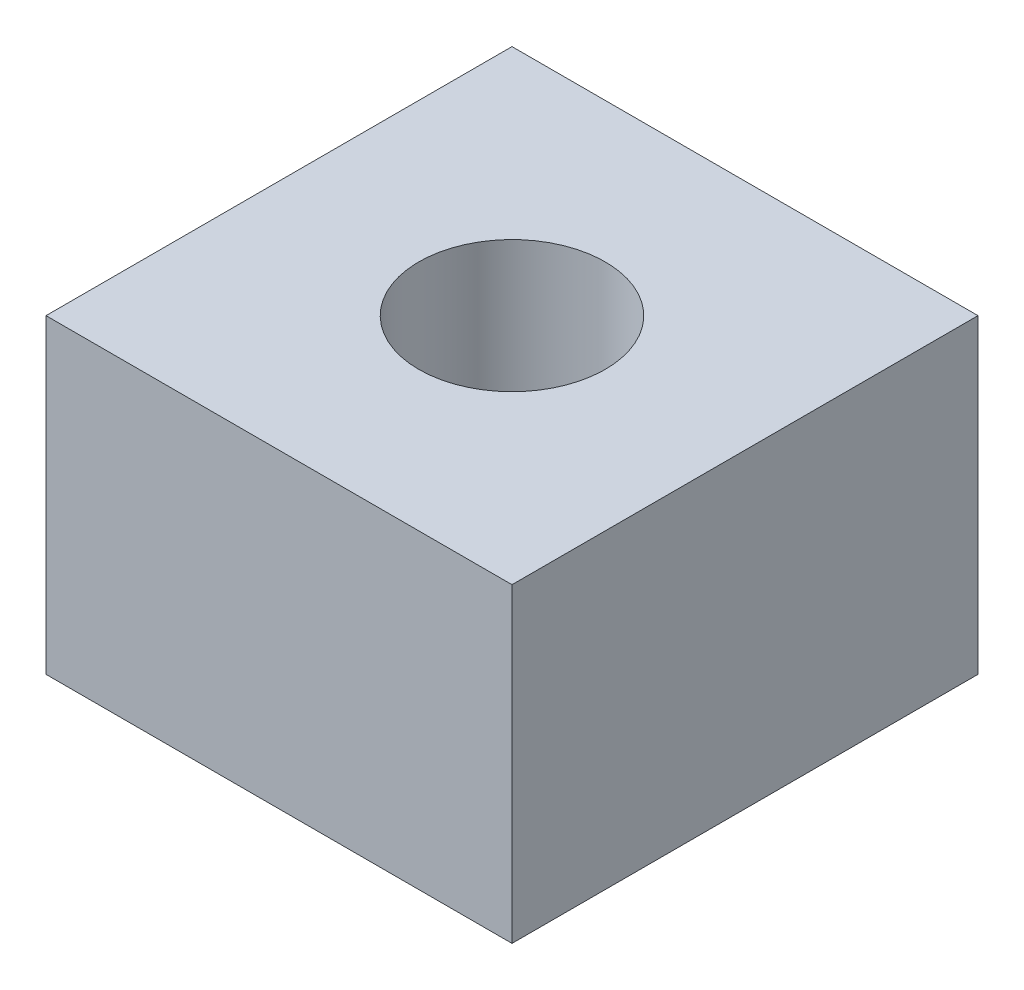
ISO-10303-21;
HEADER;
FILE_DESCRIPTION(('STEP AP214'),'2;1');
FILE_NAME('part.step','',(''),(''),'','','');
FILE_SCHEMA(('AUTOMOTIVE_DESIGN { 1 0 10303 214 1 1 1 1 }'));
ENDSEC;
DATA;
#1=APPLICATION_CONTEXT('core data for automotive mechanical design processes');
#2=APPLICATION_PROTOCOL_DEFINITION('international standard','automotive_design',2000,#1);
#3=PRODUCT_CONTEXT('',#1,'mechanical');
#4=PRODUCT('Part','Part','',(#3));
#5=PRODUCT_RELATED_PRODUCT_CATEGORY('part','',(#4));
#6=PRODUCT_DEFINITION_FORMATION('','',#4);
#7=PRODUCT_DEFINITION_CONTEXT('part definition',#1,'design');
#8=PRODUCT_DEFINITION('design','',#6,#7);
#9=PRODUCT_DEFINITION_SHAPE('','',#8);
#10=(LENGTH_UNIT() NAMED_UNIT(*) SI_UNIT(.MILLI.,.METRE.));
#11=(NAMED_UNIT(*) PLANE_ANGLE_UNIT() SI_UNIT($,.RADIAN.));
#12=(NAMED_UNIT(*) SI_UNIT($,.STERADIAN.) SOLID_ANGLE_UNIT());
#13=UNCERTAINTY_MEASURE_WITH_UNIT(LENGTH_MEASURE(1.E-05),#10,'distance_accuracy_value','');
#14=(GEOMETRIC_REPRESENTATION_CONTEXT(3) GLOBAL_UNCERTAINTY_ASSIGNED_CONTEXT((#13)) GLOBAL_UNIT_ASSIGNED_CONTEXT((#10,
#11,#12)) REPRESENTATION_CONTEXT('',''));
#15=CARTESIAN_POINT('',(0.,0.,0.));
#16=DIRECTION('',(0.,0.,1.));
#17=DIRECTION('',(1.,0.,0.));
#18=AXIS2_PLACEMENT_3D('',#15,#16,#17);
#19=CARTESIAN_POINT('',(-19.7814302383731,-7.77529588264711,30.));
#20=DIRECTION('',(1.,0.,0.));
#21=DIRECTION('',(0.,1.,0.));
#22=AXIS2_PLACEMENT_3D('',#19,#20,#21);
#23=PLANE('',#22);
#24=DIRECTION('',(0.,-1.,0.));
#25=VECTOR('',#24,1.);
#26=CARTESIAN_POINT('',(-19.7814302383731,-7.77529588264711,0.));
#27=LINE('',#26,#25);
#28=CARTESIAN_POINT('',(-19.7814302383731,-7.77529588264711,0.));
#29=VERTEX_POINT('',#28);
#30=CARTESIAN_POINT('',(-19.7814302383731,-27.7752958826471,0.));
#31=VERTEX_POINT('',#30);
#32=EDGE_CURVE('E108',#29,#31,#27,.T.);
#33=ORIENTED_EDGE('',*,*,#32,.T.);
#34=DIRECTION('',(0.,0.,-1.));
#35=VECTOR('',#34,1.);
#36=CARTESIAN_POINT('',(-19.7814302383731,-27.7752958826471,30.));
#37=LINE('',#36,#35);
#38=CARTESIAN_POINT('',(-19.7814302383731,-27.7752958826471,30.));
#39=VERTEX_POINT('',#38);
#40=EDGE_CURVE('E11',#39,#31,#37,.T.);
#41=ORIENTED_EDGE('',*,*,#40,.F.);
#42=DIRECTION('',(0.,-1.,0.));
#43=VECTOR('',#42,1.);
#44=CARTESIAN_POINT('',(-19.7814302383731,-7.77529588264711,30.));
#45=LINE('',#44,#43);
#46=CARTESIAN_POINT('',(-19.7814302383731,-7.77529588264711,30.));
#47=VERTEX_POINT('',#46);
#48=EDGE_CURVE('E92',#47,#39,#45,.T.);
#49=ORIENTED_EDGE('',*,*,#48,.F.);
#50=DIRECTION('',(0.,0.,-1.));
#51=VECTOR('',#50,1.);
#52=CARTESIAN_POINT('',(-19.7814302383731,-7.77529588264711,30.));
#53=LINE('',#52,#51);
#54=EDGE_CURVE('E104',#47,#29,#53,.T.);
#55=ORIENTED_EDGE('',*,*,#54,.T.);
#56=EDGE_LOOP('',(#33,#41,#49,#55));
#57=FACE_BOUND('',#56,.T.);
#58=ADVANCED_FACE('F40',(#57),#23,.F.);
#59=CARTESIAN_POINT('',(-19.7814302383731,-27.7752958826471,30.));
#60=DIRECTION('',(0.,1.,0.));
#61=DIRECTION('',(0.,0.,1.));
#62=AXIS2_PLACEMENT_3D('',#59,#60,#61);
#63=PLANE('',#62);
#64=CARTESIAN_POINT('',(-4.78143023837309,-27.7752958826471,15.));
#65=DIRECTION('',(0.,1.,0.));
#66=DIRECTION('',(0.,0.,1.));
#67=AXIS2_PLACEMENT_3D('',#64,#65,#66);
#68=CIRCLE('',#67,6.);
#69=CARTESIAN_POINT('',(-4.78143023837309,-27.7752958826471,21.));
#70=VERTEX_POINT('',#69);
#71=EDGE_CURVE('E112',#70,#70,#68,.T.);
#72=ORIENTED_EDGE('',*,*,#71,.T.);
#73=EDGE_LOOP('',(#72));
#74=FACE_BOUND('',#73,.T.);
#75=DIRECTION('',(1.,0.,0.));
#76=VECTOR('',#75,1.);
#77=CARTESIAN_POINT('',(-19.7814302383731,-27.7752958826471,0.));
#78=LINE('',#77,#76);
#79=CARTESIAN_POINT('',(10.2185697616269,-27.7752958826471,0.));
#80=VERTEX_POINT('',#79);
#81=EDGE_CURVE('E97',#31,#80,#78,.T.);
#82=ORIENTED_EDGE('',*,*,#81,.T.);
#83=DIRECTION('',(0.,0.,-1.));
#84=VECTOR('',#83,1.);
#85=CARTESIAN_POINT('',(10.2185697616269,-27.7752958826471,30.));
#86=LINE('',#85,#84);
#87=CARTESIAN_POINT('',(10.2185697616269,-27.7752958826471,30.));
#88=VERTEX_POINT('',#87);
#89=EDGE_CURVE('E49',#88,#80,#86,.T.);
#90=ORIENTED_EDGE('',*,*,#89,.F.);
#91=DIRECTION('',(1.,0.,0.));
#92=VECTOR('',#91,1.);
#93=CARTESIAN_POINT('',(-19.7814302383731,-27.7752958826471,30.));
#94=LINE('',#93,#92);
#95=EDGE_CURVE('E87',#39,#88,#94,.T.);
#96=ORIENTED_EDGE('',*,*,#95,.F.);
#97=ORIENTED_EDGE('',*,*,#40,.T.);
#98=EDGE_LOOP('',(#82,#90,#96,#97));
#99=FACE_BOUND('',#98,.T.);
#100=ADVANCED_FACE('F96',(#74,#99),#63,.F.);
#101=CARTESIAN_POINT('',(10.2185697616269,-7.77529588264711,30.));
#102=DIRECTION('',(-1.,0.,0.));
#103=DIRECTION('',(0.,0.,1.));
#104=AXIS2_PLACEMENT_3D('',#101,#102,#103);
#105=PLANE('',#104);
#106=DIRECTION('',(0.,1.,0.));
#107=VECTOR('',#106,1.);
#108=CARTESIAN_POINT('',(10.2185697616269,-7.77529588264711,0.));
#109=LINE('',#108,#107);
#110=CARTESIAN_POINT('',(10.2185697616269,-7.77529588264711,0.));
#111=VERTEX_POINT('',#110);
#112=EDGE_CURVE('E74',#80,#111,#109,.T.);
#113=ORIENTED_EDGE('',*,*,#112,.T.);
#114=DIRECTION('',(0.,0.,-1.));
#115=VECTOR('',#114,1.);
#116=CARTESIAN_POINT('',(10.2185697616269,-7.77529588264711,30.));
#117=LINE('',#116,#115);
#118=CARTESIAN_POINT('',(10.2185697616269,-7.77529588264711,30.));
#119=VERTEX_POINT('',#118);
#120=EDGE_CURVE('E99',#119,#111,#117,.T.);
#121=ORIENTED_EDGE('',*,*,#120,.F.);
#122=DIRECTION('',(0.,1.,0.));
#123=VECTOR('',#122,1.);
#124=CARTESIAN_POINT('',(10.2185697616269,-7.77529588264711,30.));
#125=LINE('',#124,#123);
#126=EDGE_CURVE('E90',#88,#119,#125,.T.);
#127=ORIENTED_EDGE('',*,*,#126,.F.);
#128=ORIENTED_EDGE('',*,*,#89,.T.);
#129=EDGE_LOOP('',(#113,#121,#127,#128));
#130=FACE_BOUND('',#129,.T.);
#131=ADVANCED_FACE('F100',(#130),#105,.F.);
#132=CARTESIAN_POINT('',(-19.7814302383731,-7.77529588264711,30.));
#133=DIRECTION('',(0.,-1.,0.));
#134=DIRECTION('',(0.,0.,-1.));
#135=AXIS2_PLACEMENT_3D('',#132,#133,#134);
#136=PLANE('',#135);
#137=CARTESIAN_POINT('',(-4.78143023837309,-7.77529588264711,15.));
#138=DIRECTION('',(0.,1.,0.));
#139=DIRECTION('',(0.,0.,1.));
#140=AXIS2_PLACEMENT_3D('',#137,#138,#139);
#141=CIRCLE('',#140,6.);
#142=CARTESIAN_POINT('',(-4.78143023837309,-7.77529588264711,21.));
#143=VERTEX_POINT('',#142);
#144=EDGE_CURVE('E129',#143,#143,#141,.T.);
#145=ORIENTED_EDGE('',*,*,#144,.F.);
#146=EDGE_LOOP('',(#145));
#147=FACE_BOUND('',#146,.T.);
#148=DIRECTION('',(-1.,0.,0.));
#149=VECTOR('',#148,1.);
#150=CARTESIAN_POINT('',(-19.7814302383731,-7.77529588264711,0.));
#151=LINE('',#150,#149);
#152=EDGE_CURVE('E80',#111,#29,#151,.T.);
#153=ORIENTED_EDGE('',*,*,#152,.T.);
#154=ORIENTED_EDGE('',*,*,#54,.F.);
#155=DIRECTION('',(-1.,0.,0.));
#156=VECTOR('',#155,1.);
#157=CARTESIAN_POINT('',(-19.7814302383731,-7.77529588264711,30.));
#158=LINE('',#157,#156);
#159=EDGE_CURVE('E57',#119,#47,#158,.T.);
#160=ORIENTED_EDGE('',*,*,#159,.F.);
#161=ORIENTED_EDGE('',*,*,#120,.T.);
#162=EDGE_LOOP('',(#153,#154,#160,#161));
#163=FACE_BOUND('',#162,.T.);
#164=ADVANCED_FACE('F122',(#147,#163),#136,.F.);
#165=CARTESIAN_POINT('',(0.,0.,30.));
#166=DIRECTION('',(0.,0.,1.));
#167=DIRECTION('',(1.,0.,0.));
#168=AXIS2_PLACEMENT_3D('',#165,#166,#167);
#169=PLANE('',#168);
#170=ORIENTED_EDGE('',*,*,#48,.T.);
#171=ORIENTED_EDGE('',*,*,#95,.T.);
#172=ORIENTED_EDGE('',*,*,#126,.T.);
#173=ORIENTED_EDGE('',*,*,#159,.T.);
#174=EDGE_LOOP('',(#170,#171,#172,#173));
#175=FACE_BOUND('',#174,.T.);
#176=ADVANCED_FACE('F88',(#175),#169,.T.);
#177=CARTESIAN_POINT('',(0.,0.,0.));
#178=DIRECTION('',(0.,0.,1.));
#179=DIRECTION('',(1.,0.,0.));
#180=AXIS2_PLACEMENT_3D('',#177,#178,#179);
#181=PLANE('',#180);
#182=ORIENTED_EDGE('',*,*,#32,.F.);
#183=ORIENTED_EDGE('',*,*,#152,.F.);
#184=ORIENTED_EDGE('',*,*,#112,.F.);
#185=ORIENTED_EDGE('',*,*,#81,.F.);
#186=EDGE_LOOP('',(#182,#183,#184,#185));
#187=FACE_BOUND('',#186,.T.);
#188=ADVANCED_FACE('F125',(#187),#181,.F.);
#189=CARTESIAN_POINT('',(-4.78143023837309,-27.7752958826471,15.));
#190=DIRECTION('',(0.,1.,0.));
#191=DIRECTION('',(0.,0.,1.));
#192=AXIS2_PLACEMENT_3D('',#189,#190,#191);
#193=CYLINDRICAL_SURFACE('',#192,6.);
#194=ORIENTED_EDGE('',*,*,#71,.F.);
#195=EDGE_LOOP('',(#194));
#196=FACE_BOUND('',#195,.T.);
#197=ORIENTED_EDGE('',*,*,#144,.T.);
#198=EDGE_LOOP('',(#197));
#199=FACE_BOUND('',#198,.T.);
#200=ADVANCED_FACE('F138',(#196,#199),#193,.F.);
#201=CLOSED_SHELL('',(#58,#100,#131,#164,#176,#188,#200));
#202=MANIFOLD_SOLID_BREP('B2',#201);
#203=ADVANCED_BREP_SHAPE_REPRESENTATION('',(#18,#202),#14);
#204=SHAPE_DEFINITION_REPRESENTATION(#9,#203);
ENDSEC;
END-ISO-10303-21;
